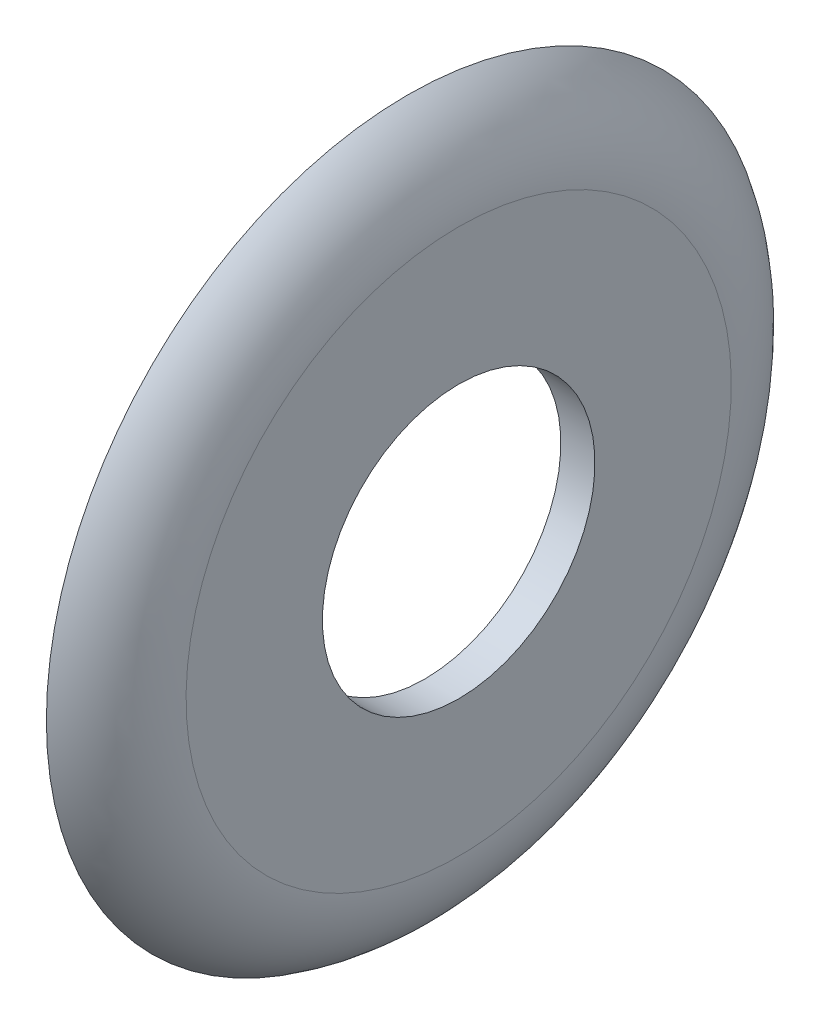
ISO-10303-21;
HEADER;
FILE_DESCRIPTION(('STEP AP214'),'2;1');
FILE_NAME('part.step','',(''),(''),'','','');
FILE_SCHEMA(('AUTOMOTIVE_DESIGN { 1 0 10303 214 1 1 1 1 }'));
ENDSEC;
DATA;
#1=APPLICATION_CONTEXT('core data for automotive mechanical design processes');
#2=APPLICATION_PROTOCOL_DEFINITION('international standard','automotive_design',2000,#1);
#3=PRODUCT_CONTEXT('',#1,'mechanical');
#4=PRODUCT('Part','Part','',(#3));
#5=PRODUCT_RELATED_PRODUCT_CATEGORY('part','',(#4));
#6=PRODUCT_DEFINITION_FORMATION('','',#4);
#7=PRODUCT_DEFINITION_CONTEXT('part definition',#1,'design');
#8=PRODUCT_DEFINITION('design','',#6,#7);
#9=PRODUCT_DEFINITION_SHAPE('','',#8);
#10=(LENGTH_UNIT() NAMED_UNIT(*) SI_UNIT(.MILLI.,.METRE.));
#11=(NAMED_UNIT(*) PLANE_ANGLE_UNIT() SI_UNIT($,.RADIAN.));
#12=(NAMED_UNIT(*) SI_UNIT($,.STERADIAN.) SOLID_ANGLE_UNIT());
#13=UNCERTAINTY_MEASURE_WITH_UNIT(LENGTH_MEASURE(1.E-05),#10,'distance_accuracy_value','');
#14=(GEOMETRIC_REPRESENTATION_CONTEXT(3) GLOBAL_UNCERTAINTY_ASSIGNED_CONTEXT((#13)) GLOBAL_UNIT_ASSIGNED_CONTEXT((#10,
#11,#12)) REPRESENTATION_CONTEXT('',''));
#15=CARTESIAN_POINT('',(0.,0.,0.));
#16=DIRECTION('',(0.,0.,1.));
#17=DIRECTION('',(1.,0.,0.));
#18=AXIS2_PLACEMENT_3D('',#15,#16,#17);
#19=CARTESIAN_POINT('',(3.47964897799222,0.,0.));
#20=DIRECTION('',(1.,0.,0.));
#21=DIRECTION('',(0.,1.,0.));
#22=AXIS2_PLACEMENT_3D('',#19,#20,#21);
#23=PLANE('',#22);
#24=CARTESIAN_POINT('',(3.47964897799222,0.,0.));
#25=DIRECTION('',(1.,0.,0.));
#26=DIRECTION('',(0.,1.,0.));
#27=AXIS2_PLACEMENT_3D('',#24,#25,#26);
#28=CIRCLE('',#27,21.1912502924479);
#29=CARTESIAN_POINT('',(3.47964897799222,21.1912502924479,0.));
#30=VERTEX_POINT('',#29);
#31=EDGE_CURVE('E55',#30,#30,#28,.T.);
#32=ORIENTED_EDGE('',*,*,#31,.F.);
#33=EDGE_LOOP('',(#32));
#34=FACE_BOUND('',#33,.T.);
#35=CARTESIAN_POINT('',(3.47964897799222,0.,0.));
#36=DIRECTION('',(1.,0.,0.));
#37=DIRECTION('',(0.,1.,0.));
#38=AXIS2_PLACEMENT_3D('',#35,#36,#37);
#39=CIRCLE('',#38,19.3117226600967);
#40=CARTESIAN_POINT('',(3.47964897799222,19.3117226600967,0.));
#41=VERTEX_POINT('',#40);
#42=EDGE_CURVE('E10',#41,#41,#39,.T.);
#43=ORIENTED_EDGE('',*,*,#42,.T.);
#44=EDGE_LOOP('',(#43));
#45=FACE_BOUND('',#44,.T.);
#46=ADVANCED_FACE('F33',(#34,#45),#23,.F.);
#47=CARTESIAN_POINT('',(-1.52035102200778,0.,0.));
#48=DIRECTION('',(1.,0.,0.));
#49=DIRECTION('',(0.,1.,0.));
#50=AXIS2_PLACEMENT_3D('',#47,#48,#49);
#51=TOROIDAL_SURFACE('',#50,15.9950978697413,6.);
#52=CARTESIAN_POINT('',(4.47964897799222,0.,0.));
#53=DIRECTION('',(1.,0.,0.));
#54=DIRECTION('',(0.,1.,0.));
#55=AXIS2_PLACEMENT_3D('',#52,#53,#54);
#56=CIRCLE('',#55,15.9950978697413);
#57=CARTESIAN_POINT('',(4.47964897799222,15.9950978697413,0.));
#58=VERTEX_POINT('',#57);
#59=EDGE_CURVE('E39',#58,#58,#56,.T.);
#60=ORIENTED_EDGE('',*,*,#59,.T.);
#61=EDGE_LOOP('',(#60));
#62=FACE_BOUND('',#61,.T.);
#63=ORIENTED_EDGE('',*,*,#42,.F.);
#64=EDGE_LOOP('',(#63));
#65=FACE_BOUND('',#64,.T.);
#66=ADVANCED_FACE('F62',(#62,#65),#51,.F.);
#67=CARTESIAN_POINT('',(4.47964897799222,0.,0.));
#68=DIRECTION('',(1.,0.,0.));
#69=DIRECTION('',(0.,1.,0.));
#70=AXIS2_PLACEMENT_3D('',#67,#68,#69);
#71=PLANE('',#70);
#72=ORIENTED_EDGE('',*,*,#59,.F.);
#73=EDGE_LOOP('',(#72));
#74=FACE_BOUND('',#73,.T.);
#75=CARTESIAN_POINT('',(4.47964897799222,0.,0.));
#76=DIRECTION('',(1.,0.,0.));
#77=DIRECTION('',(0.,1.,0.));
#78=AXIS2_PLACEMENT_3D('',#75,#76,#77);
#79=CIRCLE('',#78,7.99509786974128);
#80=CARTESIAN_POINT('',(4.47964897799222,7.99509786974128,0.));
#81=VERTEX_POINT('',#80);
#82=EDGE_CURVE('E43',#81,#81,#79,.T.);
#83=ORIENTED_EDGE('',*,*,#82,.T.);
#84=EDGE_LOOP('',(#83));
#85=FACE_BOUND('',#84,.T.);
#86=ADVANCED_FACE('F66',(#74,#85),#71,.F.);
#87=CARTESIAN_POINT('',(6.47964897799226,0.,0.));
#88=DIRECTION('',(1.,0.,0.));
#89=DIRECTION('',(0.,1.,0.));
#90=AXIS2_PLACEMENT_3D('',#87,#88,#89);
#91=CYLINDRICAL_SURFACE('',#90,7.99509786974128);
#92=ORIENTED_EDGE('',*,*,#82,.F.);
#93=EDGE_LOOP('',(#92));
#94=FACE_BOUND('',#93,.T.);
#95=CARTESIAN_POINT('',(6.47964897799226,0.,0.));
#96=DIRECTION('',(1.,0.,0.));
#97=DIRECTION('',(0.,1.,0.));
#98=AXIS2_PLACEMENT_3D('',#95,#96,#97);
#99=CIRCLE('',#98,7.99509786974128);
#100=CARTESIAN_POINT('',(6.47964897799226,7.99509786974128,0.));
#101=VERTEX_POINT('',#100);
#102=EDGE_CURVE('E47',#101,#101,#99,.T.);
#103=ORIENTED_EDGE('',*,*,#102,.T.);
#104=EDGE_LOOP('',(#103));
#105=FACE_BOUND('',#104,.T.);
#106=ADVANCED_FACE('F70',(#94,#105),#91,.F.);
#107=CARTESIAN_POINT('',(6.47964897799226,0.,0.));
#108=DIRECTION('',(1.,0.,0.));
#109=DIRECTION('',(0.,1.,0.));
#110=AXIS2_PLACEMENT_3D('',#107,#108,#109);
#111=PLANE('',#110);
#112=CARTESIAN_POINT('',(6.47964897799227,0.,0.));
#113=DIRECTION('',(1.,0.,0.));
#114=DIRECTION('',(0.,1.,0.));
#115=AXIS2_PLACEMENT_3D('',#112,#113,#114);
#116=CIRCLE('',#115,15.9950978697412);
#117=CARTESIAN_POINT('',(6.47964897799226,15.9950978697412,0.));
#118=VERTEX_POINT('',#117);
#119=EDGE_CURVE('E52',#118,#118,#116,.T.);
#120=ORIENTED_EDGE('',*,*,#119,.T.);
#121=EDGE_LOOP('',(#120));
#122=FACE_BOUND('',#121,.T.);
#123=ORIENTED_EDGE('',*,*,#102,.F.);
#124=EDGE_LOOP('',(#123));
#125=FACE_BOUND('',#124,.T.);
#126=ADVANCED_FACE('F77',(#122,#125),#111,.T.);
#127=CARTESIAN_POINT('',(0.479648977992264,0.,0.));
#128=DIRECTION('',(1.,0.,0.));
#129=DIRECTION('',(0.,1.,0.));
#130=AXIS2_PLACEMENT_3D('',#127,#128,#129);
#131=TOROIDAL_SURFACE('',#130,15.9950978697413,6.);
#132=ORIENTED_EDGE('',*,*,#119,.F.);
#133=EDGE_LOOP('',(#132));
#134=FACE_BOUND('',#133,.T.);
#135=ORIENTED_EDGE('',*,*,#31,.T.);
#136=EDGE_LOOP('',(#135));
#137=FACE_BOUND('',#136,.T.);
#138=ADVANCED_FACE('F59',(#134,#137),#131,.T.);
#139=CLOSED_SHELL('',(#46,#66,#86,#106,#126,#138));
#140=MANIFOLD_SOLID_BREP('B2',#139);
#141=ADVANCED_BREP_SHAPE_REPRESENTATION('',(#18,#140),#14);
#142=SHAPE_DEFINITION_REPRESENTATION(#9,#141);
ENDSEC;
END-ISO-10303-21;
